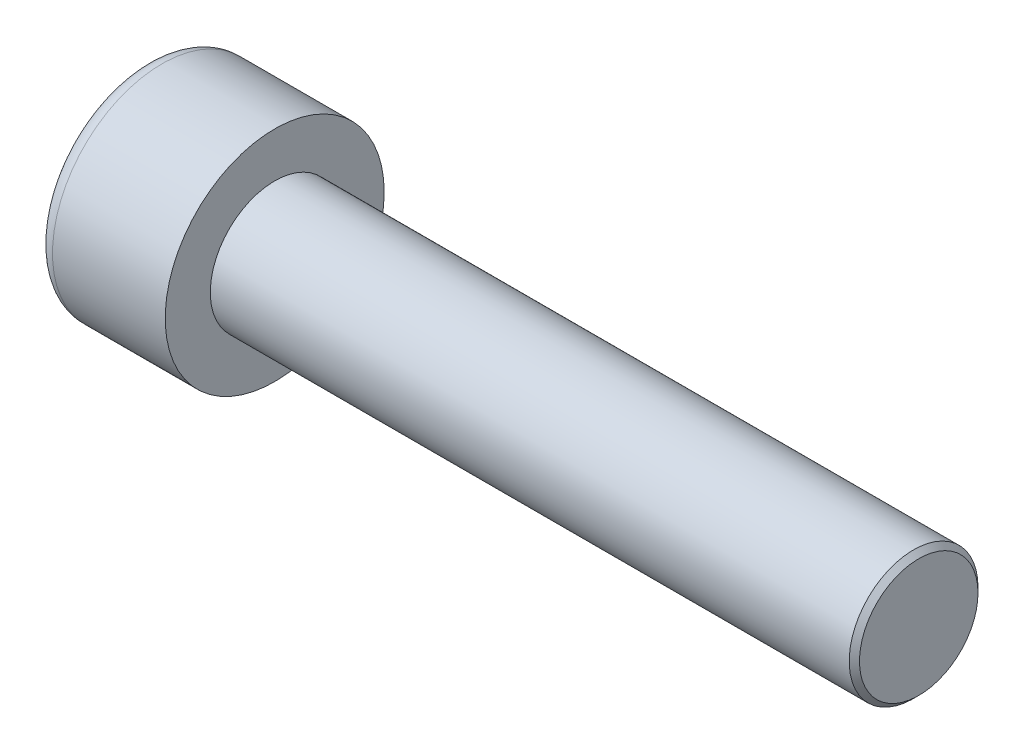
ISO-10303-21;
HEADER;
FILE_DESCRIPTION(('STEP AP214'),'2;1');
FILE_NAME('part.step','',(''),(''),'','','');
FILE_SCHEMA(('AUTOMOTIVE_DESIGN { 1 0 10303 214 1 1 1 1 }'));
ENDSEC;
DATA;
#1=APPLICATION_CONTEXT('core data for automotive mechanical design processes');
#2=APPLICATION_PROTOCOL_DEFINITION('international standard','automotive_design',2000,#1);
#3=PRODUCT_CONTEXT('',#1,'mechanical');
#4=PRODUCT('Part','Part','',(#3));
#5=PRODUCT_RELATED_PRODUCT_CATEGORY('part','',(#4));
#6=PRODUCT_DEFINITION_FORMATION('','',#4);
#7=PRODUCT_DEFINITION_CONTEXT('part definition',#1,'design');
#8=PRODUCT_DEFINITION('design','',#6,#7);
#9=PRODUCT_DEFINITION_SHAPE('','',#8);
#10=(LENGTH_UNIT() NAMED_UNIT(*) SI_UNIT(.MILLI.,.METRE.));
#11=(NAMED_UNIT(*) PLANE_ANGLE_UNIT() SI_UNIT($,.RADIAN.));
#12=(NAMED_UNIT(*) SI_UNIT($,.STERADIAN.) SOLID_ANGLE_UNIT());
#13=UNCERTAINTY_MEASURE_WITH_UNIT(LENGTH_MEASURE(1.E-05),#10,'distance_accuracy_value','');
#14=(GEOMETRIC_REPRESENTATION_CONTEXT(3) GLOBAL_UNCERTAINTY_ASSIGNED_CONTEXT((#13)) GLOBAL_UNIT_ASSIGNED_CONTEXT((#10,
#11,#12)) REPRESENTATION_CONTEXT('',''));
#15=CARTESIAN_POINT('',(0.,0.,0.));
#16=DIRECTION('',(0.,0.,1.));
#17=DIRECTION('',(1.,0.,0.));
#18=AXIS2_PLACEMENT_3D('',#15,#16,#17);
#19=CARTESIAN_POINT('',(2.5,0.,-2.3094010767585));
#20=DIRECTION('',(1.,0.,0.));
#21=DIRECTION('',(0.,0.,-1.));
#22=AXIS2_PLACEMENT_3D('',#19,#20,#21);
#23=PLANE('',#22);
#24=CARTESIAN_POINT('',(2.5,0.,0.));
#25=DIRECTION('',(1.,0.,0.));
#26=DIRECTION('',(0.,0.,-1.));
#27=AXIS2_PLACEMENT_3D('',#24,#25,#26);
#28=CIRCLE('',#27,2.);
#29=CARTESIAN_POINT('',(2.5,-0.999999999999999,-1.73205080756888));
#30=VERTEX_POINT('',#29);
#31=CARTESIAN_POINT('',(2.5,-2.,0.));
#32=VERTEX_POINT('',#31);
#33=EDGE_CURVE('E164',#30,#32,#28,.F.);
#34=ORIENTED_EDGE('',*,*,#33,.F.);
#35=DIRECTION('',(0.,0.866025403784439,-0.5));
#36=VECTOR('',#35,1.);
#37=CARTESIAN_POINT('',(2.5,-2.,-1.15470053837925));
#38=LINE('',#37,#36);
#39=CARTESIAN_POINT('',(2.5,-2.,-1.15470053837925));
#40=VERTEX_POINT('',#39);
#41=EDGE_CURVE('E172',#40,#30,#38,.T.);
#42=ORIENTED_EDGE('',*,*,#41,.F.);
#43=DIRECTION('',(0.,0.,-1.));
#44=VECTOR('',#43,1.);
#45=CARTESIAN_POINT('',(2.5,-2.,1.15470053837925));
#46=LINE('',#45,#44);
#47=EDGE_CURVE('E189',#32,#40,#46,.T.);
#48=ORIENTED_EDGE('',*,*,#47,.F.);
#49=EDGE_LOOP('',(#34,#42,#48));
#50=FACE_BOUND('',#49,.T.);
#51=ADVANCED_FACE('F41',(#50),#23,.F.);
#52=CARTESIAN_POINT('',(2.5,-1.,1.73205080756888));
#53=VERTEX_POINT('',#52);
#54=EDGE_CURVE('E294',#32,#53,#28,.F.);
#55=ORIENTED_EDGE('',*,*,#54,.F.);
#56=CARTESIAN_POINT('',(2.5,-2.,1.15470053837925));
#57=VERTEX_POINT('',#56);
#58=EDGE_CURVE('E190',#57,#32,#46,.T.);
#59=ORIENTED_EDGE('',*,*,#58,.F.);
#60=DIRECTION('',(0.,-0.866025403784438,-0.5));
#61=VECTOR('',#60,1.);
#62=CARTESIAN_POINT('',(2.5,0.,2.3094010767585));
#63=LINE('',#62,#61);
#64=EDGE_CURVE('E185',#53,#57,#63,.T.);
#65=ORIENTED_EDGE('',*,*,#64,.F.);
#66=EDGE_LOOP('',(#55,#59,#65));
#67=FACE_BOUND('',#66,.T.);
#68=ADVANCED_FACE('F130',(#67),#23,.F.);
#69=CARTESIAN_POINT('',(2.5,1.,1.73205080756888));
#70=VERTEX_POINT('',#69);
#71=EDGE_CURVE('E290',#53,#70,#28,.F.);
#72=ORIENTED_EDGE('',*,*,#71,.F.);
#73=CARTESIAN_POINT('',(2.5,0.,2.3094010767585));
#74=VERTEX_POINT('',#73);
#75=EDGE_CURVE('E186',#74,#53,#63,.T.);
#76=ORIENTED_EDGE('',*,*,#75,.F.);
#77=DIRECTION('',(0.,-0.866025403784438,0.5));
#78=VECTOR('',#77,1.);
#79=CARTESIAN_POINT('',(2.5,2.,1.15470053837925));
#80=LINE('',#79,#78);
#81=EDGE_CURVE('E181',#70,#74,#80,.T.);
#82=ORIENTED_EDGE('',*,*,#81,.F.);
#83=EDGE_LOOP('',(#72,#76,#82));
#84=FACE_BOUND('',#83,.T.);
#85=ADVANCED_FACE('F136',(#84),#23,.F.);
#86=CARTESIAN_POINT('',(2.5,2.,0.));
#87=VERTEX_POINT('',#86);
#88=EDGE_CURVE('E161',#70,#87,#28,.F.);
#89=ORIENTED_EDGE('',*,*,#88,.F.);
#90=CARTESIAN_POINT('',(2.5,2.,1.15470053837925));
#91=VERTEX_POINT('',#90);
#92=EDGE_CURVE('E182',#91,#70,#80,.T.);
#93=ORIENTED_EDGE('',*,*,#92,.F.);
#94=DIRECTION('',(0.,0.,1.));
#95=VECTOR('',#94,1.);
#96=CARTESIAN_POINT('',(2.5,2.,-1.15470053837925));
#97=LINE('',#96,#95);
#98=EDGE_CURVE('E176',#87,#91,#97,.T.);
#99=ORIENTED_EDGE('',*,*,#98,.F.);
#100=EDGE_LOOP('',(#89,#93,#99));
#101=FACE_BOUND('',#100,.T.);
#102=ADVANCED_FACE('F150',(#101),#23,.F.);
#103=CARTESIAN_POINT('',(2.5,0.,0.));
#104=DIRECTION('',(1.,0.,0.));
#105=DIRECTION('',(0.,0.,-1.));
#106=AXIS2_PLACEMENT_3D('',#103,#104,#105);
#107=CIRCLE('',#106,2.);
#108=CARTESIAN_POINT('',(2.5,1.,-1.73205080756888));
#109=VERTEX_POINT('',#108);
#110=EDGE_CURVE('E56',#109,#87,#107,.T.);
#111=ORIENTED_EDGE('',*,*,#110,.T.);
#112=CARTESIAN_POINT('',(2.5,2.,-1.15470053837925));
#113=VERTEX_POINT('',#112);
#114=EDGE_CURVE('E169',#113,#87,#97,.T.);
#115=ORIENTED_EDGE('',*,*,#114,.F.);
#116=DIRECTION('',(0.,0.866025403784438,0.5));
#117=VECTOR('',#116,1.);
#118=CARTESIAN_POINT('',(2.5,0.,-2.3094010767585));
#119=LINE('',#118,#117);
#120=EDGE_CURVE('E166',#109,#113,#119,.T.);
#121=ORIENTED_EDGE('',*,*,#120,.F.);
#122=EDGE_LOOP('',(#111,#115,#121));
#123=FACE_BOUND('',#122,.T.);
#124=ADVANCED_FACE('F141',(#123),#23,.F.);
#125=EDGE_CURVE('E154',#109,#30,#28,.F.);
#126=ORIENTED_EDGE('',*,*,#125,.F.);
#127=CARTESIAN_POINT('',(2.5,0.,-2.3094010767585));
#128=VERTEX_POINT('',#127);
#129=EDGE_CURVE('E157',#128,#109,#119,.T.);
#130=ORIENTED_EDGE('',*,*,#129,.F.);
#131=EDGE_CURVE('E159',#30,#128,#38,.T.);
#132=ORIENTED_EDGE('',*,*,#131,.F.);
#133=EDGE_LOOP('',(#126,#130,#132));
#134=FACE_BOUND('',#133,.T.);
#135=ADVANCED_FACE('F132',(#134),#23,.F.);
#136=CARTESIAN_POINT('',(0.,0.,0.));
#137=DIRECTION('',(1.,0.,0.));
#138=DIRECTION('',(0.,0.,-1.));
#139=AXIS2_PLACEMENT_3D('',#136,#137,#138);
#140=PLANE('',#139);
#141=CARTESIAN_POINT('',(0.,0.,0.));
#142=DIRECTION('',(1.,0.,0.));
#143=DIRECTION('',(0.,0.,-1.));
#144=AXIS2_PLACEMENT_3D('',#141,#142,#143);
#145=CIRCLE('',#144,3.625);
#146=CARTESIAN_POINT('',(0.,0.,-3.625));
#147=VERTEX_POINT('',#146);
#148=EDGE_CURVE('E229',#147,#147,#145,.F.);
#149=ORIENTED_EDGE('',*,*,#148,.T.);
#150=EDGE_LOOP('',(#149));
#151=FACE_BOUND('',#150,.T.);
#152=DIRECTION('',(0.,0.866025403784439,-0.5));
#153=VECTOR('',#152,1.);
#154=CARTESIAN_POINT('',(0.,-2.,-1.15470053837925));
#155=LINE('',#154,#153);
#156=CARTESIAN_POINT('',(0.,-2.,-1.15470053837925));
#157=VERTEX_POINT('',#156);
#158=CARTESIAN_POINT('',(0.,0.,-2.3094010767585));
#159=VERTEX_POINT('',#158);
#160=EDGE_CURVE('E64',#157,#159,#155,.T.);
#161=ORIENTED_EDGE('',*,*,#160,.T.);
#162=DIRECTION('',(0.,0.866025403784438,0.5));
#163=VECTOR('',#162,1.);
#164=CARTESIAN_POINT('',(0.,0.,-2.3094010767585));
#165=LINE('',#164,#163);
#166=CARTESIAN_POINT('',(0.,2.,-1.15470053837925));
#167=VERTEX_POINT('',#166);
#168=EDGE_CURVE('E195',#159,#167,#165,.T.);
#169=ORIENTED_EDGE('',*,*,#168,.T.);
#170=DIRECTION('',(0.,0.,1.));
#171=VECTOR('',#170,1.);
#172=CARTESIAN_POINT('',(0.,2.,-1.15470053837925));
#173=LINE('',#172,#171);
#174=CARTESIAN_POINT('',(0.,2.,1.15470053837925));
#175=VERTEX_POINT('',#174);
#176=EDGE_CURVE('E198',#167,#175,#173,.T.);
#177=ORIENTED_EDGE('',*,*,#176,.T.);
#178=DIRECTION('',(0.,-0.866025403784438,0.5));
#179=VECTOR('',#178,1.);
#180=CARTESIAN_POINT('',(0.,2.,1.15470053837925));
#181=LINE('',#180,#179);
#182=CARTESIAN_POINT('',(0.,0.,2.3094010767585));
#183=VERTEX_POINT('',#182);
#184=EDGE_CURVE('E201',#175,#183,#181,.T.);
#185=ORIENTED_EDGE('',*,*,#184,.T.);
#186=DIRECTION('',(0.,-0.866025403784438,-0.5));
#187=VECTOR('',#186,1.);
#188=CARTESIAN_POINT('',(0.,0.,2.3094010767585));
#189=LINE('',#188,#187);
#190=CARTESIAN_POINT('',(0.,-2.,1.15470053837925));
#191=VERTEX_POINT('',#190);
#192=EDGE_CURVE('E204',#183,#191,#189,.T.);
#193=ORIENTED_EDGE('',*,*,#192,.T.);
#194=DIRECTION('',(0.,0.,-1.));
#195=VECTOR('',#194,1.);
#196=CARTESIAN_POINT('',(0.,-2.,1.15470053837925));
#197=LINE('',#196,#195);
#198=EDGE_CURVE('E207',#191,#157,#197,.T.);
#199=ORIENTED_EDGE('',*,*,#198,.T.);
#200=EDGE_LOOP('',(#161,#169,#177,#185,#193,#199));
#201=FACE_BOUND('',#200,.T.);
#202=ADVANCED_FACE('F140',(#151,#201),#140,.F.);
#203=CARTESIAN_POINT('',(5.,0.,0.));
#204=DIRECTION('',(1.,0.,0.));
#205=DIRECTION('',(0.,0.,-1.));
#206=AXIS2_PLACEMENT_3D('',#203,#204,#205);
#207=PLANE('',#206);
#208=CARTESIAN_POINT('',(5.,0.,0.));
#209=DIRECTION('',(1.,0.,0.));
#210=DIRECTION('',(0.,0.,-1.));
#211=AXIS2_PLACEMENT_3D('',#208,#209,#210);
#212=CIRCLE('',#211,4.25);
#213=CARTESIAN_POINT('',(5.,0.,-4.25));
#214=VERTEX_POINT('',#213);
#215=EDGE_CURVE('E162',#214,#214,#212,.T.);
#216=ORIENTED_EDGE('',*,*,#215,.T.);
#217=EDGE_LOOP('',(#216));
#218=FACE_BOUND('',#217,.T.);
#219=CARTESIAN_POINT('',(5.,0.,0.));
#220=DIRECTION('',(1.,0.,0.));
#221=DIRECTION('',(0.,0.,-1.));
#222=AXIS2_PLACEMENT_3D('',#219,#220,#221);
#223=CIRCLE('',#222,2.5);
#224=CARTESIAN_POINT('',(5.,0.,-2.5));
#225=VERTEX_POINT('',#224);
#226=EDGE_CURVE('E220',#225,#225,#223,.T.);
#227=ORIENTED_EDGE('',*,*,#226,.F.);
#228=EDGE_LOOP('',(#227));
#229=FACE_BOUND('',#228,.T.);
#230=ADVANCED_FACE('F147',(#218,#229),#207,.T.);
#231=CARTESIAN_POINT('',(5.,0.,0.));
#232=DIRECTION('',(-1.,0.,0.));
#233=DIRECTION('',(0.,0.,1.));
#234=AXIS2_PLACEMENT_3D('',#231,#232,#233);
#235=CYLINDRICAL_SURFACE('',#234,4.25);
#236=CARTESIAN_POINT('',(0.625,0.,0.));
#237=DIRECTION('',(1.,0.,0.));
#238=DIRECTION('',(0.,0.,-1.));
#239=AXIS2_PLACEMENT_3D('',#236,#237,#238);
#240=CIRCLE('',#239,4.25);
#241=CARTESIAN_POINT('',(0.625,0.,-4.25));
#242=VERTEX_POINT('',#241);
#243=EDGE_CURVE('E226',#242,#242,#240,.T.);
#244=ORIENTED_EDGE('',*,*,#243,.T.);
#245=EDGE_LOOP('',(#244));
#246=FACE_BOUND('',#245,.T.);
#247=ORIENTED_EDGE('',*,*,#215,.F.);
#248=EDGE_LOOP('',(#247));
#249=FACE_BOUND('',#248,.T.);
#250=ADVANCED_FACE('F245',(#246,#249),#235,.T.);
#251=CARTESIAN_POINT('',(30.,0.,0.));
#252=DIRECTION('',(-1.,0.,0.));
#253=DIRECTION('',(0.,0.,1.));
#254=AXIS2_PLACEMENT_3D('',#251,#252,#253);
#255=CYLINDRICAL_SURFACE('',#254,2.5);
#256=CARTESIAN_POINT('',(29.8,0.,0.));
#257=DIRECTION('',(1.,0.,0.));
#258=DIRECTION('',(0.,0.,-1.));
#259=AXIS2_PLACEMENT_3D('',#256,#257,#258);
#260=CIRCLE('',#259,2.5);
#261=CARTESIAN_POINT('',(29.8,0.,-2.5));
#262=VERTEX_POINT('',#261);
#263=EDGE_CURVE('E11',#262,#262,#260,.F.);
#264=ORIENTED_EDGE('',*,*,#263,.T.);
#265=EDGE_LOOP('',(#264));
#266=FACE_BOUND('',#265,.T.);
#267=ORIENTED_EDGE('',*,*,#226,.T.);
#268=EDGE_LOOP('',(#267));
#269=FACE_BOUND('',#268,.T.);
#270=ADVANCED_FACE('F242',(#266,#269),#255,.T.);
#271=CARTESIAN_POINT('',(30.,0.,0.));
#272=DIRECTION('',(1.,0.,0.));
#273=DIRECTION('',(0.,0.,-1.));
#274=AXIS2_PLACEMENT_3D('',#271,#272,#273);
#275=PLANE('',#274);
#276=CARTESIAN_POINT('',(30.,0.,0.));
#277=DIRECTION('',(1.,0.,0.));
#278=DIRECTION('',(0.,0.,-1.));
#279=AXIS2_PLACEMENT_3D('',#276,#277,#278);
#280=CIRCLE('',#279,2.3);
#281=CARTESIAN_POINT('',(30.,0.,-2.3));
#282=VERTEX_POINT('',#281);
#283=EDGE_CURVE('E49',#282,#282,#280,.T.);
#284=ORIENTED_EDGE('',*,*,#283,.T.);
#285=EDGE_LOOP('',(#284));
#286=FACE_BOUND('',#285,.T.);
#287=ADVANCED_FACE('F234',(#286),#275,.T.);
#288=CARTESIAN_POINT('',(2.5,-2.,-1.15470053837925));
#289=DIRECTION('',(0.,0.5,0.866025403784439));
#290=DIRECTION('',(0.,-0.866025403784439,0.5));
#291=AXIS2_PLACEMENT_3D('',#288,#289,#290);
#292=PLANE('',#291);
#293=ORIENTED_EDGE('',*,*,#160,.F.);
#294=DIRECTION('',(-1.,0.,0.));
#295=VECTOR('',#294,1.);
#296=CARTESIAN_POINT('',(2.5,-2.,-1.15470053837925));
#297=LINE('',#296,#295);
#298=EDGE_CURVE('E193',#40,#157,#297,.T.);
#299=ORIENTED_EDGE('',*,*,#298,.F.);
#300=ORIENTED_EDGE('',*,*,#41,.T.);
#301=ORIENTED_EDGE('',*,*,#131,.T.);
#302=DIRECTION('',(-1.,0.,0.));
#303=VECTOR('',#302,1.);
#304=CARTESIAN_POINT('',(2.5,0.,-2.3094010767585));
#305=LINE('',#304,#303);
#306=EDGE_CURVE('E175',#128,#159,#305,.T.);
#307=ORIENTED_EDGE('',*,*,#306,.T.);
#308=EDGE_LOOP('',(#293,#299,#300,#301,#307));
#309=FACE_BOUND('',#308,.T.);
#310=ADVANCED_FACE('F260',(#309),#292,.T.);
#311=CARTESIAN_POINT('',(2.5,0.,-2.3094010767585));
#312=DIRECTION('',(0.,-0.5,0.866025403784438));
#313=DIRECTION('',(0.,-0.866025403784438,-0.5));
#314=AXIS2_PLACEMENT_3D('',#311,#312,#313);
#315=PLANE('',#314);
#316=ORIENTED_EDGE('',*,*,#168,.F.);
#317=ORIENTED_EDGE('',*,*,#306,.F.);
#318=ORIENTED_EDGE('',*,*,#129,.T.);
#319=ORIENTED_EDGE('',*,*,#120,.T.);
#320=DIRECTION('',(-1.,0.,0.));
#321=VECTOR('',#320,1.);
#322=CARTESIAN_POINT('',(2.5,2.,-1.15470053837925));
#323=LINE('',#322,#321);
#324=EDGE_CURVE('E217',#113,#167,#323,.T.);
#325=ORIENTED_EDGE('',*,*,#324,.T.);
#326=EDGE_LOOP('',(#316,#317,#318,#319,#325));
#327=FACE_BOUND('',#326,.T.);
#328=ADVANCED_FACE('F174',(#327),#315,.T.);
#329=CARTESIAN_POINT('',(2.5,2.,-1.15470053837925));
#330=DIRECTION('',(0.,-1.,0.));
#331=DIRECTION('',(0.,0.,-1.));
#332=AXIS2_PLACEMENT_3D('',#329,#330,#331);
#333=PLANE('',#332);
#334=ORIENTED_EDGE('',*,*,#176,.F.);
#335=ORIENTED_EDGE('',*,*,#324,.F.);
#336=ORIENTED_EDGE('',*,*,#114,.T.);
#337=ORIENTED_EDGE('',*,*,#98,.T.);
#338=DIRECTION('',(-1.,0.,0.));
#339=VECTOR('',#338,1.);
#340=CARTESIAN_POINT('',(2.5,2.,1.15470053837925));
#341=LINE('',#340,#339);
#342=EDGE_CURVE('E215',#91,#175,#341,.T.);
#343=ORIENTED_EDGE('',*,*,#342,.T.);
#344=EDGE_LOOP('',(#334,#335,#336,#337,#343));
#345=FACE_BOUND('',#344,.T.);
#346=ADVANCED_FACE('F265',(#345),#333,.T.);
#347=CARTESIAN_POINT('',(2.5,2.,1.15470053837925));
#348=DIRECTION('',(0.,-0.5,-0.866025403784439));
#349=DIRECTION('',(0.,0.866025403784439,-0.5));
#350=AXIS2_PLACEMENT_3D('',#347,#348,#349);
#351=PLANE('',#350);
#352=ORIENTED_EDGE('',*,*,#184,.F.);
#353=ORIENTED_EDGE('',*,*,#342,.F.);
#354=ORIENTED_EDGE('',*,*,#92,.T.);
#355=ORIENTED_EDGE('',*,*,#81,.T.);
#356=DIRECTION('',(-1.,0.,0.));
#357=VECTOR('',#356,1.);
#358=CARTESIAN_POINT('',(2.5,0.,2.3094010767585));
#359=LINE('',#358,#357);
#360=EDGE_CURVE('E213',#74,#183,#359,.T.);
#361=ORIENTED_EDGE('',*,*,#360,.T.);
#362=EDGE_LOOP('',(#352,#353,#354,#355,#361));
#363=FACE_BOUND('',#362,.T.);
#364=ADVANCED_FACE('F268',(#363),#351,.T.);
#365=CARTESIAN_POINT('',(2.5,0.,2.3094010767585));
#366=DIRECTION('',(0.,0.5,-0.866025403784439));
#367=DIRECTION('',(0.,0.866025403784439,0.5));
#368=AXIS2_PLACEMENT_3D('',#365,#366,#367);
#369=PLANE('',#368);
#370=ORIENTED_EDGE('',*,*,#192,.F.);
#371=ORIENTED_EDGE('',*,*,#360,.F.);
#372=ORIENTED_EDGE('',*,*,#75,.T.);
#373=ORIENTED_EDGE('',*,*,#64,.T.);
#374=DIRECTION('',(-1.,0.,0.));
#375=VECTOR('',#374,1.);
#376=CARTESIAN_POINT('',(2.5,-2.,1.15470053837925));
#377=LINE('',#376,#375);
#378=EDGE_CURVE('E211',#57,#191,#377,.T.);
#379=ORIENTED_EDGE('',*,*,#378,.T.);
#380=EDGE_LOOP('',(#370,#371,#372,#373,#379));
#381=FACE_BOUND('',#380,.T.);
#382=ADVANCED_FACE('F125',(#381),#369,.T.);
#383=CARTESIAN_POINT('',(2.5,-2.,1.15470053837925));
#384=DIRECTION('',(0.,1.,0.));
#385=DIRECTION('',(0.,0.,1.));
#386=AXIS2_PLACEMENT_3D('',#383,#384,#385);
#387=PLANE('',#386);
#388=ORIENTED_EDGE('',*,*,#198,.F.);
#389=ORIENTED_EDGE('',*,*,#378,.F.);
#390=ORIENTED_EDGE('',*,*,#58,.T.);
#391=ORIENTED_EDGE('',*,*,#47,.T.);
#392=ORIENTED_EDGE('',*,*,#298,.T.);
#393=EDGE_LOOP('',(#388,#389,#390,#391,#392));
#394=FACE_BOUND('',#393,.T.);
#395=ADVANCED_FACE('F118',(#394),#387,.T.);
#396=CARTESIAN_POINT('',(2.5,0.,0.));
#397=DIRECTION('',(-1.,0.,0.));
#398=DIRECTION('',(0.,0.,1.));
#399=AXIS2_PLACEMENT_3D('',#396,#397,#398);
#400=CONICAL_SURFACE('',#399,2.,1.04719755119659);
#401=CARTESIAN_POINT('',(3.65470053837926,0.,0.));
#402=VERTEX_POINT('',#401);
#403=VERTEX_LOOP('',#402);
#404=FACE_BOUND('',#403,.T.);
#405=ORIENTED_EDGE('',*,*,#110,.F.);
#406=ORIENTED_EDGE('',*,*,#125,.T.);
#407=ORIENTED_EDGE('',*,*,#33,.T.);
#408=ORIENTED_EDGE('',*,*,#54,.T.);
#409=ORIENTED_EDGE('',*,*,#71,.T.);
#410=ORIENTED_EDGE('',*,*,#88,.T.);
#411=EDGE_LOOP('',(#405,#406,#407,#408,#409,#410));
#412=FACE_BOUND('',#411,.T.);
#413=ADVANCED_FACE('F115',(#404,#412),#400,.F.);
#414=CARTESIAN_POINT('',(0.625,0.,0.));
#415=DIRECTION('',(1.,0.,0.));
#416=DIRECTION('',(0.,0.,-1.));
#417=AXIS2_PLACEMENT_3D('',#414,#415,#416);
#418=TOROIDAL_SURFACE('',#417,3.625,0.625);
#419=ORIENTED_EDGE('',*,*,#148,.F.);
#420=EDGE_LOOP('',(#419));
#421=FACE_BOUND('',#420,.T.);
#422=ORIENTED_EDGE('',*,*,#243,.F.);
#423=EDGE_LOOP('',(#422));
#424=FACE_BOUND('',#423,.T.);
#425=ADVANCED_FACE('F117',(#421,#424),#418,.T.);
#426=CARTESIAN_POINT('',(30.,0.,0.));
#427=DIRECTION('',(-1.,0.,0.));
#428=DIRECTION('',(0.,0.,1.));
#429=AXIS2_PLACEMENT_3D('',#426,#427,#428);
#430=CONICAL_SURFACE('',#429,2.3,0.785398163397451);
#431=ORIENTED_EDGE('',*,*,#263,.F.);
#432=EDGE_LOOP('',(#431));
#433=FACE_BOUND('',#432,.T.);
#434=ORIENTED_EDGE('',*,*,#283,.F.);
#435=EDGE_LOOP('',(#434));
#436=FACE_BOUND('',#435,.T.);
#437=ADVANCED_FACE('F43',(#433,#436),#430,.T.);
#438=CLOSED_SHELL('',(#51,#68,#85,#102,#124,#135,#202,#230,#250,#270,#287,#310,#328,#346,#364,
#382,#395,#413,#425,#437));
#439=MANIFOLD_SOLID_BREP('B2',#438);
#440=ADVANCED_BREP_SHAPE_REPRESENTATION('',(#18,#439),#14);
#441=SHAPE_DEFINITION_REPRESENTATION(#9,#440);
ENDSEC;
END-ISO-10303-21;
